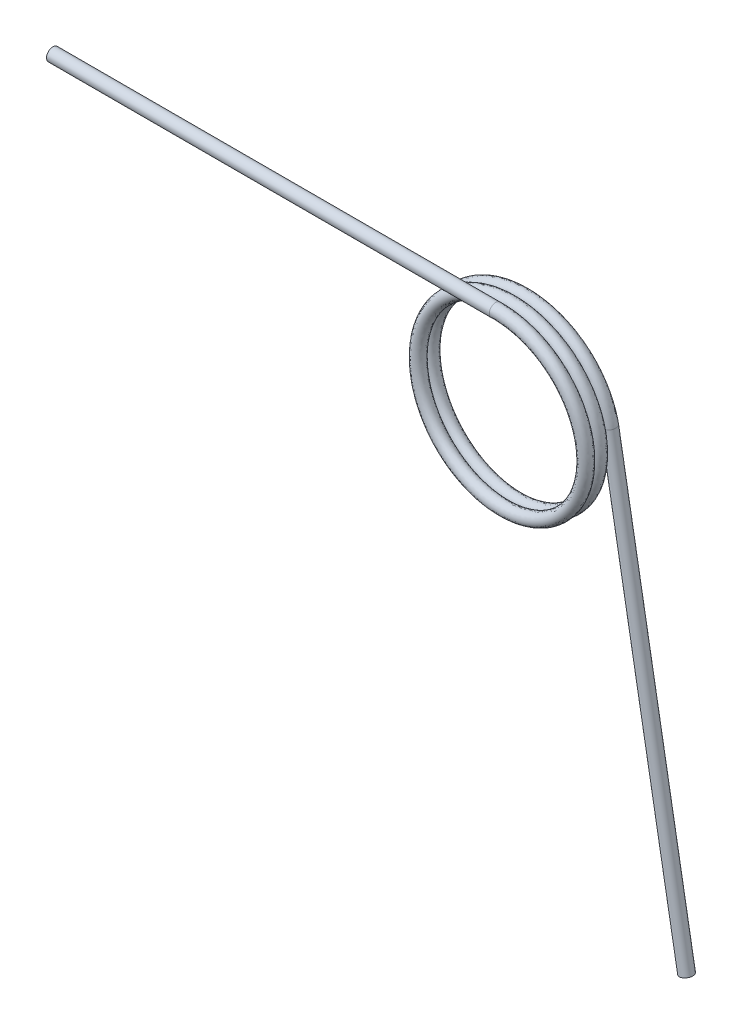
ISO-10303-21;
HEADER;
FILE_DESCRIPTION(('STEP AP214'),'2;1');
FILE_NAME('part.step','',(''),(''),'','','');
FILE_SCHEMA(('AUTOMOTIVE_DESIGN { 1 0 10303 214 1 1 1 1 }'));
ENDSEC;
DATA;
#1=APPLICATION_CONTEXT('core data for automotive mechanical design processes');
#2=APPLICATION_PROTOCOL_DEFINITION('international standard','automotive_design',2000,#1);
#3=PRODUCT_CONTEXT('',#1,'mechanical');
#4=PRODUCT('Part','Part','',(#3));
#5=PRODUCT_RELATED_PRODUCT_CATEGORY('part','',(#4));
#6=PRODUCT_DEFINITION_FORMATION('','',#4);
#7=PRODUCT_DEFINITION_CONTEXT('part definition',#1,'design');
#8=PRODUCT_DEFINITION('design','',#6,#7);
#9=PRODUCT_DEFINITION_SHAPE('','',#8);
#10=(LENGTH_UNIT() NAMED_UNIT(*) SI_UNIT(.MILLI.,.METRE.));
#11=(NAMED_UNIT(*) PLANE_ANGLE_UNIT() SI_UNIT($,.RADIAN.));
#12=(NAMED_UNIT(*) SI_UNIT($,.STERADIAN.) SOLID_ANGLE_UNIT());
#13=UNCERTAINTY_MEASURE_WITH_UNIT(LENGTH_MEASURE(1.E-05),#10,'distance_accuracy_value','');
#14=(GEOMETRIC_REPRESENTATION_CONTEXT(3) GLOBAL_UNCERTAINTY_ASSIGNED_CONTEXT((#13)) GLOBAL_UNIT_ASSIGNED_CONTEXT((#10,
#11,#12)) REPRESENTATION_CONTEXT('',''));
#15=CARTESIAN_POINT('',(0.,0.,0.));
#16=DIRECTION('',(0.,0.,1.));
#17=DIRECTION('',(1.,0.,0.));
#18=AXIS2_PLACEMENT_3D('',#15,#16,#17);
#19=CARTESIAN_POINT('',(0.,2.945,-0.215));
#20=CARTESIAN_POINT('',(-1.70029654276345,2.945,-0.178808333333333));
#21=CARTESIAN_POINT('',(-2.55044481414517,1.4725,-0.142616666666667));
#22=CARTESIAN_POINT('',(-3.4005930855269,0.,-0.106425));
#23=CARTESIAN_POINT('',(-2.55044481414517,-1.4725,-0.0702333333333334));
#24=CARTESIAN_POINT('',(-1.70029654276345,-2.945,-0.0340416666666667));
#25=CARTESIAN_POINT('',(0.,-2.945,0.00214999999999997));
#26=CARTESIAN_POINT('',(1.70029654276345,-2.945,0.0383416666666666));
#27=CARTESIAN_POINT('',(2.55044481414517,-1.4725,0.0745333333333333));
#28=CARTESIAN_POINT('',(3.4005930855269,0.,0.110725));
#29=CARTESIAN_POINT('',(2.55044481414517,1.4725,0.146916666666667));
#30=CARTESIAN_POINT('',(1.70029654276345,2.945,0.183108333333333));
#31=CARTESIAN_POINT('',(0.,2.945,0.2193));
#32=CARTESIAN_POINT('',(-1.70029654276345,2.945,0.255491666666667));
#33=CARTESIAN_POINT('',(-2.55044481414517,1.4725,0.291683333333333));
#34=CARTESIAN_POINT('',(-3.4005930855269,0.,0.327875));
#35=CARTESIAN_POINT('',(-2.55044481414517,-1.4725,0.364066666666667));
#36=CARTESIAN_POINT('',(-1.70029654276345,-2.945,0.400258333333333));
#37=CARTESIAN_POINT('',(0.,-2.945,0.43645));
#38=CARTESIAN_POINT('',(1.70029654276345,-2.945,0.472641666666667));
#39=CARTESIAN_POINT('',(2.55044481414517,-1.4725,0.508833333333333));
#40=CARTESIAN_POINT('',(3.4005930855269,0.,0.545025));
#41=CARTESIAN_POINT('',(2.55044481414517,1.4725,0.581216666666667));
#42=CARTESIAN_POINT('',(1.70029654276345,2.945,0.617408333333333));
#43=CARTESIAN_POINT('',(0.,2.945,0.6536));
#44=CARTESIAN_POINT('',(-1.70029654276345,2.945,0.689791666666667));
#45=CARTESIAN_POINT('',(-2.55044481414517,1.4725,0.725983333333333));
#46=CARTESIAN_POINT('',(-3.4005930855269,0.,0.762175));
#47=CARTESIAN_POINT('',(-2.55044481414517,-1.4725,0.798366666666667));
#48=CARTESIAN_POINT('',(-1.70029654276345,-2.945,0.834558333333333));
#49=CARTESIAN_POINT('',(0.,-2.945,0.87075));
#50=CARTESIAN_POINT('',(1.70029654276345,-2.945,0.906941666666667));
#51=CARTESIAN_POINT('',(2.55044481414517,-1.4725,0.943133333333333));
#52=CARTESIAN_POINT('',(3.4005930855269,0.,0.979325));
#53=CARTESIAN_POINT('',(2.55044481414517,1.4725,1.01551666666667));
#54=CARTESIAN_POINT('',(1.70029654276345,2.945,1.05170833333333));
#55=CARTESIAN_POINT('',(0.,2.945,1.0879));
#56=CARTESIAN_POINT('',(0.,3.375,-0.215));
#57=CARTESIAN_POINT('',(-1.94855715851499,3.375,-0.178808333333333));
#58=CARTESIAN_POINT('',(-2.92283573777248,1.6875,-0.142616666666667));
#59=CARTESIAN_POINT('',(-3.89711431702997,0.,-0.106425));
#60=CARTESIAN_POINT('',(-2.92283573777248,-1.6875,-0.0702333333333334));
#61=CARTESIAN_POINT('',(-1.94855715851499,-3.375,-0.0340416666666667));
#62=CARTESIAN_POINT('',(0.,-3.375,0.00214999999999997));
#63=CARTESIAN_POINT('',(1.94855715851499,-3.375,0.0383416666666666));
#64=CARTESIAN_POINT('',(2.92283573777248,-1.6875,0.0745333333333333));
#65=CARTESIAN_POINT('',(3.89711431702997,0.,0.110725));
#66=CARTESIAN_POINT('',(2.92283573777248,1.6875,0.146916666666667));
#67=CARTESIAN_POINT('',(1.94855715851499,3.375,0.183108333333333));
#68=CARTESIAN_POINT('',(0.,3.375,0.2193));
#69=CARTESIAN_POINT('',(-1.94855715851499,3.375,0.255491666666667));
#70=CARTESIAN_POINT('',(-2.92283573777248,1.6875,0.291683333333333));
#71=CARTESIAN_POINT('',(-3.89711431702997,0.,0.327875));
#72=CARTESIAN_POINT('',(-2.92283573777248,-1.6875,0.364066666666667));
#73=CARTESIAN_POINT('',(-1.94855715851499,-3.375,0.400258333333333));
#74=CARTESIAN_POINT('',(0.,-3.375,0.43645));
#75=CARTESIAN_POINT('',(1.94855715851499,-3.375,0.472641666666667));
#76=CARTESIAN_POINT('',(2.92283573777248,-1.6875,0.508833333333333));
#77=CARTESIAN_POINT('',(3.89711431702997,0.,0.545025));
#78=CARTESIAN_POINT('',(2.92283573777248,1.6875,0.581216666666667));
#79=CARTESIAN_POINT('',(1.94855715851499,3.375,0.617408333333333));
#80=CARTESIAN_POINT('',(0.,3.375,0.6536));
#81=CARTESIAN_POINT('',(-1.94855715851499,3.375,0.689791666666667));
#82=CARTESIAN_POINT('',(-2.92283573777248,1.6875,0.725983333333333));
#83=CARTESIAN_POINT('',(-3.89711431702997,0.,0.762175));
#84=CARTESIAN_POINT('',(-2.92283573777248,-1.6875,0.798366666666667));
#85=CARTESIAN_POINT('',(-1.94855715851499,-3.375,0.834558333333333));
#86=CARTESIAN_POINT('',(0.,-3.375,0.87075));
#87=CARTESIAN_POINT('',(1.94855715851499,-3.375,0.906941666666667));
#88=CARTESIAN_POINT('',(2.92283573777248,-1.6875,0.943133333333333));
#89=CARTESIAN_POINT('',(3.89711431702997,0.,0.979325));
#90=CARTESIAN_POINT('',(2.92283573777248,1.6875,1.01551666666667));
#91=CARTESIAN_POINT('',(1.94855715851499,3.375,1.05170833333333));
#92=CARTESIAN_POINT('',(0.,3.375,1.0879));
#93=CARTESIAN_POINT('',(0.,3.375,0.215));
#94=CARTESIAN_POINT('',(-1.94855715851499,3.375,0.251191666666667));
#95=CARTESIAN_POINT('',(-2.92283573777248,1.6875,0.287383333333333));
#96=CARTESIAN_POINT('',(-3.89711431702997,0.,0.323575));
#97=CARTESIAN_POINT('',(-2.92283573777248,-1.6875,0.359766666666667));
#98=CARTESIAN_POINT('',(-1.94855715851499,-3.375,0.395958333333333));
#99=CARTESIAN_POINT('',(0.,-3.375,0.43215));
#100=CARTESIAN_POINT('',(1.94855715851499,-3.375,0.468341666666667));
#101=CARTESIAN_POINT('',(2.92283573777248,-1.6875,0.504533333333333));
#102=CARTESIAN_POINT('',(3.89711431702997,0.,0.540725));
#103=CARTESIAN_POINT('',(2.92283573777248,1.6875,0.576916666666667));
#104=CARTESIAN_POINT('',(1.94855715851499,3.375,0.613108333333333));
#105=CARTESIAN_POINT('',(0.,3.375,0.6493));
#106=CARTESIAN_POINT('',(-1.94855715851499,3.375,0.685491666666667));
#107=CARTESIAN_POINT('',(-2.92283573777248,1.6875,0.721683333333333));
#108=CARTESIAN_POINT('',(-3.89711431702997,0.,0.757875));
#109=CARTESIAN_POINT('',(-2.92283573777248,-1.6875,0.794066666666667));
#110=CARTESIAN_POINT('',(-1.94855715851499,-3.375,0.830258333333333));
#111=CARTESIAN_POINT('',(0.,-3.375,0.86645));
#112=CARTESIAN_POINT('',(1.94855715851499,-3.375,0.902641666666667));
#113=CARTESIAN_POINT('',(2.92283573777248,-1.6875,0.938833333333334));
#114=CARTESIAN_POINT('',(3.89711431702997,0.,0.975025));
#115=CARTESIAN_POINT('',(2.92283573777248,1.6875,1.01121666666667));
#116=CARTESIAN_POINT('',(1.94855715851499,3.375,1.04740833333333));
#117=CARTESIAN_POINT('',(0.,3.375,1.0836));
#118=CARTESIAN_POINT('',(-1.94855715851499,3.375,1.11979166666667));
#119=CARTESIAN_POINT('',(-2.92283573777248,1.6875,1.15598333333333));
#120=CARTESIAN_POINT('',(-3.89711431702997,0.,1.192175));
#121=CARTESIAN_POINT('',(-2.92283573777248,-1.6875,1.22836666666667));
#122=CARTESIAN_POINT('',(-1.94855715851499,-3.375,1.26455833333333));
#123=CARTESIAN_POINT('',(0.,-3.375,1.30075));
#124=CARTESIAN_POINT('',(1.94855715851499,-3.375,1.33694166666667));
#125=CARTESIAN_POINT('',(2.92283573777248,-1.6875,1.37313333333333));
#126=CARTESIAN_POINT('',(3.89711431702997,0.,1.409325));
#127=CARTESIAN_POINT('',(2.92283573777248,1.6875,1.44551666666667));
#128=CARTESIAN_POINT('',(1.94855715851499,3.375,1.48170833333333));
#129=CARTESIAN_POINT('',(0.,3.375,1.5179));
#130=CARTESIAN_POINT('',(0.,2.945,0.215));
#131=CARTESIAN_POINT('',(-1.70029654276345,2.945,0.251191666666667));
#132=CARTESIAN_POINT('',(-2.55044481414517,1.4725,0.287383333333333));
#133=CARTESIAN_POINT('',(-3.4005930855269,0.,0.323575));
#134=CARTESIAN_POINT('',(-2.55044481414517,-1.4725,0.359766666666667));
#135=CARTESIAN_POINT('',(-1.70029654276345,-2.945,0.395958333333333));
#136=CARTESIAN_POINT('',(0.,-2.945,0.43215));
#137=CARTESIAN_POINT('',(1.70029654276345,-2.945,0.468341666666667));
#138=CARTESIAN_POINT('',(2.55044481414517,-1.4725,0.504533333333333));
#139=CARTESIAN_POINT('',(3.4005930855269,0.,0.540725));
#140=CARTESIAN_POINT('',(2.55044481414517,1.4725,0.576916666666667));
#141=CARTESIAN_POINT('',(1.70029654276345,2.945,0.613108333333333));
#142=CARTESIAN_POINT('',(0.,2.945,0.6493));
#143=CARTESIAN_POINT('',(-1.70029654276345,2.945,0.685491666666667));
#144=CARTESIAN_POINT('',(-2.55044481414517,1.4725,0.721683333333333));
#145=CARTESIAN_POINT('',(-3.4005930855269,0.,0.757875));
#146=CARTESIAN_POINT('',(-2.55044481414517,-1.4725,0.794066666666667));
#147=CARTESIAN_POINT('',(-1.70029654276345,-2.945,0.830258333333333));
#148=CARTESIAN_POINT('',(0.,-2.945,0.86645));
#149=CARTESIAN_POINT('',(1.70029654276345,-2.945,0.902641666666667));
#150=CARTESIAN_POINT('',(2.55044481414517,-1.4725,0.938833333333333));
#151=CARTESIAN_POINT('',(3.4005930855269,0.,0.975025));
#152=CARTESIAN_POINT('',(2.55044481414517,1.4725,1.01121666666667));
#153=CARTESIAN_POINT('',(1.70029654276345,2.945,1.04740833333333));
#154=CARTESIAN_POINT('',(0.,2.945,1.0836));
#155=CARTESIAN_POINT('',(-1.70029654276345,2.945,1.11979166666667));
#156=CARTESIAN_POINT('',(-2.55044481414517,1.4725,1.15598333333333));
#157=CARTESIAN_POINT('',(-3.4005930855269,0.,1.192175));
#158=CARTESIAN_POINT('',(-2.55044481414517,-1.4725,1.22836666666667));
#159=CARTESIAN_POINT('',(-1.70029654276345,-2.945,1.26455833333333));
#160=CARTESIAN_POINT('',(0.,-2.945,1.30075));
#161=CARTESIAN_POINT('',(1.70029654276345,-2.945,1.33694166666667));
#162=CARTESIAN_POINT('',(2.55044481414517,-1.4725,1.37313333333333));
#163=CARTESIAN_POINT('',(3.4005930855269,0.,1.409325));
#164=CARTESIAN_POINT('',(2.55044481414517,1.4725,1.44551666666667));
#165=CARTESIAN_POINT('',(1.70029654276345,2.945,1.48170833333333));
#166=CARTESIAN_POINT('',(0.,2.945,1.5179));
#167=CARTESIAN_POINT('',(0.,2.515,0.215));
#168=CARTESIAN_POINT('',(-1.45203592701191,2.515,0.251191666666667));
#169=CARTESIAN_POINT('',(-2.17805389051786,1.2575,0.287383333333333));
#170=CARTESIAN_POINT('',(-2.90407185402382,0.,0.323575));
#171=CARTESIAN_POINT('',(-2.17805389051786,-1.2575,0.359766666666667));
#172=CARTESIAN_POINT('',(-1.45203592701191,-2.515,0.395958333333334));
#173=CARTESIAN_POINT('',(0.,-2.515,0.43215));
#174=CARTESIAN_POINT('',(1.45203592701191,-2.515,0.468341666666667));
#175=CARTESIAN_POINT('',(2.17805389051786,-1.2575,0.504533333333333));
#176=CARTESIAN_POINT('',(2.90407185402382,0.,0.540725));
#177=CARTESIAN_POINT('',(2.17805389051786,1.2575,0.576916666666667));
#178=CARTESIAN_POINT('',(1.45203592701191,2.515,0.613108333333333));
#179=CARTESIAN_POINT('',(0.,2.515,0.6493));
#180=CARTESIAN_POINT('',(-1.45203592701191,2.515,0.685491666666667));
#181=CARTESIAN_POINT('',(-2.17805389051786,1.2575,0.721683333333333));
#182=CARTESIAN_POINT('',(-2.90407185402382,0.,0.757875));
#183=CARTESIAN_POINT('',(-2.17805389051786,-1.2575,0.794066666666667));
#184=CARTESIAN_POINT('',(-1.45203592701191,-2.515,0.830258333333333));
#185=CARTESIAN_POINT('',(0.,-2.515,0.86645));
#186=CARTESIAN_POINT('',(1.45203592701191,-2.515,0.902641666666667));
#187=CARTESIAN_POINT('',(2.17805389051786,-1.2575,0.938833333333334));
#188=CARTESIAN_POINT('',(2.90407185402382,0.,0.975025));
#189=CARTESIAN_POINT('',(2.17805389051786,1.2575,1.01121666666667));
#190=CARTESIAN_POINT('',(1.45203592701191,2.515,1.04740833333333));
#191=CARTESIAN_POINT('',(0.,2.515,1.0836));
#192=CARTESIAN_POINT('',(-1.45203592701191,2.515,1.11979166666667));
#193=CARTESIAN_POINT('',(-2.17805389051786,1.2575,1.15598333333333));
#194=CARTESIAN_POINT('',(-2.90407185402382,0.,1.192175));
#195=CARTESIAN_POINT('',(-2.17805389051786,-1.2575,1.22836666666667));
#196=CARTESIAN_POINT('',(-1.45203592701191,-2.515,1.26455833333333));
#197=CARTESIAN_POINT('',(0.,-2.515,1.30075));
#198=CARTESIAN_POINT('',(1.45203592701191,-2.515,1.33694166666667));
#199=CARTESIAN_POINT('',(2.17805389051786,-1.2575,1.37313333333333));
#200=CARTESIAN_POINT('',(2.90407185402382,0.,1.409325));
#201=CARTESIAN_POINT('',(2.17805389051786,1.2575,1.44551666666667));
#202=CARTESIAN_POINT('',(1.45203592701191,2.515,1.48170833333333));
#203=CARTESIAN_POINT('',(0.,2.515,1.5179));
#204=CARTESIAN_POINT('',(0.,2.515,-0.215));
#205=CARTESIAN_POINT('',(-1.45203592701191,2.515,-0.178808333333333));
#206=CARTESIAN_POINT('',(-2.17805389051786,1.2575,-0.142616666666667));
#207=CARTESIAN_POINT('',(-2.90407185402382,0.,-0.106425));
#208=CARTESIAN_POINT('',(-2.17805389051786,-1.2575,-0.0702333333333334));
#209=CARTESIAN_POINT('',(-1.45203592701191,-2.515,-0.0340416666666667));
#210=CARTESIAN_POINT('',(0.,-2.515,0.00214999999999997));
#211=CARTESIAN_POINT('',(1.45203592701191,-2.515,0.0383416666666666));
#212=CARTESIAN_POINT('',(2.17805389051786,-1.2575,0.0745333333333333));
#213=CARTESIAN_POINT('',(2.90407185402382,0.,0.110725));
#214=CARTESIAN_POINT('',(2.17805389051786,1.2575,0.146916666666667));
#215=CARTESIAN_POINT('',(1.45203592701191,2.515,0.183108333333333));
#216=CARTESIAN_POINT('',(0.,2.515,0.2193));
#217=CARTESIAN_POINT('',(-1.45203592701191,2.515,0.255491666666667));
#218=CARTESIAN_POINT('',(-2.17805389051786,1.2575,0.291683333333333));
#219=CARTESIAN_POINT('',(-2.90407185402382,0.,0.327875));
#220=CARTESIAN_POINT('',(-2.17805389051786,-1.2575,0.364066666666667));
#221=CARTESIAN_POINT('',(-1.45203592701191,-2.515,0.400258333333333));
#222=CARTESIAN_POINT('',(0.,-2.515,0.43645));
#223=CARTESIAN_POINT('',(1.45203592701191,-2.515,0.472641666666667));
#224=CARTESIAN_POINT('',(2.17805389051786,-1.2575,0.508833333333333));
#225=CARTESIAN_POINT('',(2.90407185402382,0.,0.545025));
#226=CARTESIAN_POINT('',(2.17805389051786,1.2575,0.581216666666667));
#227=CARTESIAN_POINT('',(1.45203592701191,2.515,0.617408333333333));
#228=CARTESIAN_POINT('',(0.,2.515,0.6536));
#229=CARTESIAN_POINT('',(-1.45203592701191,2.515,0.689791666666667));
#230=CARTESIAN_POINT('',(-2.17805389051786,1.2575,0.725983333333333));
#231=CARTESIAN_POINT('',(-2.90407185402382,0.,0.762175));
#232=CARTESIAN_POINT('',(-2.17805389051786,-1.2575,0.798366666666667));
#233=CARTESIAN_POINT('',(-1.45203592701191,-2.515,0.834558333333333));
#234=CARTESIAN_POINT('',(0.,-2.515,0.87075));
#235=CARTESIAN_POINT('',(1.45203592701191,-2.515,0.906941666666667));
#236=CARTESIAN_POINT('',(2.17805389051786,-1.2575,0.943133333333333));
#237=CARTESIAN_POINT('',(2.90407185402382,0.,0.979325));
#238=CARTESIAN_POINT('',(2.17805389051786,1.2575,1.01551666666667));
#239=CARTESIAN_POINT('',(1.45203592701191,2.515,1.05170833333333));
#240=CARTESIAN_POINT('',(0.,2.515,1.0879));
#241=CARTESIAN_POINT('',(0.,2.945,-0.215));
#242=CARTESIAN_POINT('',(-1.70029654276345,2.945,-0.178808333333333));
#243=CARTESIAN_POINT('',(-2.55044481414517,1.4725,-0.142616666666667));
#244=CARTESIAN_POINT('',(-3.4005930855269,0.,-0.106425));
#245=CARTESIAN_POINT('',(-2.55044481414517,-1.4725,-0.0702333333333334));
#246=CARTESIAN_POINT('',(-1.70029654276345,-2.945,-0.0340416666666667));
#247=CARTESIAN_POINT('',(0.,-2.945,0.00214999999999997));
#248=CARTESIAN_POINT('',(1.70029654276345,-2.945,0.0383416666666666));
#249=CARTESIAN_POINT('',(2.55044481414517,-1.4725,0.0745333333333333));
#250=CARTESIAN_POINT('',(3.4005930855269,0.,0.110725));
#251=CARTESIAN_POINT('',(2.55044481414517,1.4725,0.146916666666667));
#252=CARTESIAN_POINT('',(1.70029654276345,2.945,0.183108333333333));
#253=CARTESIAN_POINT('',(0.,2.945,0.2193));
#254=CARTESIAN_POINT('',(-1.70029654276345,2.945,0.255491666666667));
#255=CARTESIAN_POINT('',(-2.55044481414517,1.4725,0.291683333333333));
#256=CARTESIAN_POINT('',(-3.4005930855269,0.,0.327875));
#257=CARTESIAN_POINT('',(-2.55044481414517,-1.4725,0.364066666666667));
#258=CARTESIAN_POINT('',(-1.70029654276345,-2.945,0.400258333333333));
#259=CARTESIAN_POINT('',(0.,-2.945,0.43645));
#260=CARTESIAN_POINT('',(1.70029654276345,-2.945,0.472641666666667));
#261=CARTESIAN_POINT('',(2.55044481414517,-1.4725,0.508833333333333));
#262=CARTESIAN_POINT('',(3.4005930855269,0.,0.545025));
#263=CARTESIAN_POINT('',(2.55044481414517,1.4725,0.581216666666667));
#264=CARTESIAN_POINT('',(1.70029654276345,2.945,0.617408333333333));
#265=CARTESIAN_POINT('',(0.,2.945,0.6536));
#266=CARTESIAN_POINT('',(-1.70029654276345,2.945,0.689791666666667));
#267=CARTESIAN_POINT('',(-2.55044481414517,1.4725,0.725983333333333));
#268=CARTESIAN_POINT('',(-3.4005930855269,0.,0.762175));
#269=CARTESIAN_POINT('',(-2.55044481414517,-1.4725,0.798366666666667));
#270=CARTESIAN_POINT('',(-1.70029654276345,-2.945,0.834558333333333));
#271=CARTESIAN_POINT('',(0.,-2.945,0.87075));
#272=CARTESIAN_POINT('',(1.70029654276345,-2.945,0.906941666666667));
#273=CARTESIAN_POINT('',(2.55044481414517,-1.4725,0.943133333333333));
#274=CARTESIAN_POINT('',(3.4005930855269,0.,0.979325));
#275=CARTESIAN_POINT('',(2.55044481414517,1.4725,1.01551666666667));
#276=CARTESIAN_POINT('',(1.70029654276345,2.945,1.05170833333333));
#277=CARTESIAN_POINT('',(0.,2.945,1.0879));
#278=(BOUNDED_SURFACE() B_SPLINE_SURFACE(3,2,((#19,#20,#21,#22,#23,#24,#25,#26,#27,#28,#29,#30,
#31,#32,#33,#34,#35,#36,#37,#38,#39,#40,#41,#42,#43,#44,#45,#46,#47,#48,#49,#50,#51,#52,#53,#54,
#55),(#56,#57,#58,#59,#60,#61,#62,#63,#64,#65,#66,#67,#68,#69,#70,#71,#72,#73,#74,#75,#76,#77,
#78,#79,#80,#81,#82,#83,#84,#85,#86,#87,#88,#89,#90,#91,#92),(#93,#94,#95,#96,#97,#98,#99,#100,
#101,#102,#103,#104,#105,#106,#107,#108,#109,#110,#111,#112,#113,#114,#115,#116,#117,#118,#119,
#120,#121,#122,#123,#124,#125,#126,#127,#128,#129),(#130,#131,#132,#133,#134,#135,#136,#137,
#138,#139,#140,#141,#142,#143,#144,#145,#146,#147,#148,#149,#150,#151,#152,#153,#154,#155,#156,
#157,#158,#159,#160,#161,#162,#163,#164,#165,#166),(#167,#168,#169,#170,#171,#172,#173,#174,
#175,#176,#177,#178,#179,#180,#181,#182,#183,#184,#185,#186,#187,#188,#189,#190,#191,#192,#193,
#194,#195,#196,#197,#198,#199,#200,#201,#202,#203),(#204,#205,#206,#207,#208,#209,#210,#211,
#212,#213,#214,#215,#216,#217,#218,#219,#220,#221,#222,#223,#224,#225,#226,#227,#228,#229,#230,
#231,#232,#233,#234,#235,#236,#237,#238,#239,#240),(#241,#242,#243,#244,#245,#246,#247,#248,
#249,#250,#251,#252,#253,#254,#255,#256,#257,#258,#259,#260,#261,#262,#263,#264,#265,#266,#267,
#268,#269,#270,#271,#272,#273,#274,#275,#276,#277)),.UNSPECIFIED.,.T.,.F.,
.F.) B_SPLINE_SURFACE_WITH_KNOTS((4,3,4),(3,2,2,2,2,2,2,2,2,2,2,2,2,2,2,2,2,2,3),(0.,0.5,1.),
(0.,0.0555555555555556,0.111111111111111,0.166666666666667,0.222222222222222,0.277777777777778,
0.333333333333333,0.388888888888889,0.444444444444444,0.5,0.555555555555556,0.611111111111111,
0.666666666666667,0.722222222222222,0.777777777777778,0.833333333333333,0.888888888888889,
0.944444444444444,1.),
.UNSPECIFIED.) GEOMETRIC_REPRESENTATION_ITEM() RATIONAL_B_SPLINE_SURFACE(((1.,0.866025403784439,
1.,0.866025403784439,1.,0.866025403784439,1.,0.866025403784439,1.,0.866025403784439,1.,
0.866025403784439,1.,0.866025403784439,1.,0.866025403784439,1.,0.866025403784439,1.,
0.866025403784439,1.,0.866025403784439,1.,0.866025403784439,1.,0.866025403784439,1.,
0.866025403784439,1.,0.866025403784439,1.,0.866025403784439,1.,0.866025403784439,1.,
0.866025403784439,1.),(0.333333333333333,0.288675134594813,0.333333333333333,0.288675134594813,
0.333333333333333,0.288675134594813,0.333333333333333,0.288675134594813,0.333333333333333,
0.288675134594813,0.333333333333333,0.288675134594813,0.333333333333333,0.288675134594813,
0.333333333333333,0.288675134594813,0.333333333333333,0.288675134594813,0.333333333333333,
0.288675134594813,0.333333333333333,0.288675134594813,0.333333333333333,0.288675134594813,
0.333333333333333,0.288675134594813,0.333333333333333,0.288675134594813,0.333333333333333,
0.288675134594813,0.333333333333333,0.288675134594813,0.333333333333333,0.288675134594813,
0.333333333333333,0.288675134594813,0.333333333333333),(0.333333333333333,0.288675134594813,
0.333333333333333,0.288675134594813,0.333333333333333,0.288675134594813,0.333333333333333,
0.288675134594813,0.333333333333333,0.288675134594813,0.333333333333333,0.288675134594813,
0.333333333333333,0.288675134594813,0.333333333333333,0.288675134594813,0.333333333333333,
0.288675134594813,0.333333333333333,0.288675134594813,0.333333333333333,0.288675134594813,
0.333333333333333,0.288675134594813,0.333333333333333,0.288675134594813,0.333333333333333,
0.288675134594813,0.333333333333333,0.288675134594813,0.333333333333333,0.288675134594813,
0.333333333333333,0.288675134594813,0.333333333333333,0.288675134594813,0.333333333333333),(1.,
0.866025403784439,1.,0.866025403784439,1.,0.866025403784439,1.,0.866025403784439,1.,
0.866025403784439,1.,0.866025403784439,1.,0.866025403784439,1.,0.866025403784439,1.,
0.866025403784439,1.,0.866025403784439,1.,0.866025403784439,1.,0.866025403784439,1.,
0.866025403784439,1.,0.866025403784439,1.,0.866025403784439,1.,0.866025403784439,1.,
0.866025403784439,1.,0.866025403784439,1.),(0.333333333333333,0.288675134594813,
0.333333333333333,0.288675134594813,0.333333333333333,0.288675134594813,0.333333333333333,
0.288675134594813,0.333333333333333,0.288675134594813,0.333333333333333,0.288675134594813,
0.333333333333333,0.288675134594813,0.333333333333333,0.288675134594813,0.333333333333333,
0.288675134594813,0.333333333333333,0.288675134594813,0.333333333333333,0.288675134594813,
0.333333333333333,0.288675134594813,0.333333333333333,0.288675134594813,0.333333333333333,
0.288675134594813,0.333333333333333,0.288675134594813,0.333333333333333,0.288675134594813,
0.333333333333333,0.288675134594813,0.333333333333333,0.288675134594813,0.333333333333333),
(0.333333333333333,0.288675134594813,0.333333333333333,0.288675134594813,0.333333333333333,
0.288675134594813,0.333333333333333,0.288675134594813,0.333333333333333,0.288675134594813,
0.333333333333333,0.288675134594813,0.333333333333333,0.288675134594813,0.333333333333333,
0.288675134594813,0.333333333333333,0.288675134594813,0.333333333333333,0.288675134594813,
0.333333333333333,0.288675134594813,0.333333333333333,0.288675134594813,0.333333333333333,
0.288675134594813,0.333333333333333,0.288675134594813,0.333333333333333,0.288675134594813,
0.333333333333333,0.288675134594813,0.333333333333333,0.288675134594813,0.333333333333333,
0.288675134594813,0.333333333333333),(1.,0.866025403784439,1.,0.866025403784439,1.,
0.866025403784439,1.,0.866025403784439,1.,0.866025403784439,1.,0.866025403784439,1.,
0.866025403784439,1.,0.866025403784439,1.,0.866025403784439,1.,0.866025403784439,1.,
0.866025403784439,1.,0.866025403784439,1.,0.866025403784439,1.,0.866025403784439,1.,
0.866025403784439,1.,0.866025403784439,1.,0.866025403784439,1.,0.866025403784439,1.))) REPRESENTATION_ITEM('') SURFACE());
#279=CARTESIAN_POINT('',(2.94239100570403,-0.123936151110097,0.541978850004137));
#280=CARTESIAN_POINT('',(2.93871071864706,-0.0882297979870135,0.542848703910686));
#281=CARTESIAN_POINT('',(2.93573370136734,-0.0524561192601714,0.543898442779504));
#282=CARTESIAN_POINT('',(2.93178684356249,0.00126089021852464,0.545462392790058));
#283=CARTESIAN_POINT('',(2.93055702455397,0.0191879065672348,0.545982274988312));
#284=CARTESIAN_POINT('',(2.92824878773339,0.0550490372665367,0.547000945224128));
#285=CARTESIAN_POINT('',(2.9271703390526,0.0729831494198308,0.547499737547977));
#286=CARTESIAN_POINT('',(2.92515447332862,0.108821935556432,0.548460054935103));
#287=CARTESIAN_POINT('',(2.92421676091779,0.126726590924886,0.5489216570794));
#288=CARTESIAN_POINT('',(2.92251028753349,0.162556368196737,0.549802114174605));
#289=CARTESIAN_POINT('',(2.92174163490512,0.180481495867369,0.550220941620999));
#290=CARTESIAN_POINT('',(2.92046011978981,0.216306135021606,0.551011992340297));
#291=CARTESIAN_POINT('',(2.91994672633664,0.234205621798469,0.551384311137142));
#292=CARTESIAN_POINT('',(2.91962593051045,0.261054027281792,0.551910007711176));
#293=CARTESIAN_POINT('',(2.91959379206514,0.269999218941921,0.552079705338982));
#294=CARTESIAN_POINT('',(2.91980716547732,0.287885168319576,0.552409163697722));
#295=CARTESIAN_POINT('',(2.92005258536428,0.296825926524305,0.552568927701719));
#296=CARTESIAN_POINT('',(2.92098647294862,0.310811735772954,0.552813727578783));
#297=CARTESIAN_POINT('',(2.92143696830905,0.315866635034941,0.552901155174885));
#298=CARTESIAN_POINT('',(2.92250486648998,0.322665238990843,0.553020075997244));
#299=CARTESIAN_POINT('',(2.92282891015001,0.324449035293586,0.553051404761411));
#300=CARTESIAN_POINT('',(2.92350287989077,0.327327653293321,0.553102954564255));
#301=CARTESIAN_POINT('',(2.92379959651021,0.328434916810594,0.553123029545006));
#302=CARTESIAN_POINT('',(2.92450042466657,0.330580389001461,0.553162939978818));
#303=CARTESIAN_POINT('',(2.9249006283193,0.3316196692713,0.553182761124694));
#304=CARTESIAN_POINT('',(2.92572889495134,0.333141454573458,0.553214133502473));
#305=CARTESIAN_POINT('',(2.92606768991925,0.333668177070376,0.553225497439557));
#306=CARTESIAN_POINT('',(2.92675113025998,0.334449742569465,0.553244236724578));
#307=CARTESIAN_POINT('',(2.92705571525055,0.334736526152003,0.553251671697744));
#308=CARTESIAN_POINT('',(2.92794219793731,0.335265857513979,0.553268914704837));
#309=CARTESIAN_POINT('',(2.92858711526835,0.335423182268953,0.553278179743168));
#310=CARTESIAN_POINT('',(2.92956588064314,0.335313548231536,0.553287483858984));
#311=CARTESIAN_POINT('',(2.92992281292418,0.33518835158292,0.553289713307278));
#312=CARTESIAN_POINT('',(2.93083423558497,0.334745503101734,0.55329379919123));
#313=CARTESIAN_POINT('',(2.93134698968291,0.334354227642613,0.553294243286288));
#314=CARTESIAN_POINT('',(2.93256019132052,0.333246051202894,0.553293042209838));
#315=CARTESIAN_POINT('',(2.93320074509631,0.332470755746979,0.553290060005953));
#316=CARTESIAN_POINT('',(2.93439042969501,0.330848794755495,0.553282450960126));
#317=CARTESIAN_POINT('',(2.93493878099141,0.330001603738645,0.553277811039743));
#318=CARTESIAN_POINT('',(2.93665010355292,0.327155770398576,0.5532612009349));
#319=CARTESIAN_POINT('',(2.93769090798369,0.325084819155039,0.553247510603808));
#320=CARTESIAN_POINT('',(2.93963996318481,0.320880707433147,0.553219054673843));
#321=CARTESIAN_POINT('',(2.94054786592182,0.318747400570043,0.553204286398341));
#322=CARTESIAN_POINT('',(2.94314293279971,0.312303890208538,0.553159606607217));
#323=CARTESIAN_POINT('',(2.94470492048526,0.30794311500125,0.553129272038442));
#324=CARTESIAN_POINT('',(2.94912107339706,0.294855114236517,0.553040811212938));
#325=CARTESIAN_POINT('',(2.95173554260602,0.28605079716852,0.55298468798263));
#326=CARTESIAN_POINT('',(2.95665061410111,0.268346973900376,0.552881834896887));
#327=CARTESIAN_POINT('',(2.95895085466589,0.259447370505712,0.552835115838178));
#328=CARTESIAN_POINT('',(2.96332870013901,0.241598904732666,0.552752342571005));
#329=CARTESIAN_POINT('',(2.96540642582376,0.232650071876841,0.552716282558132));
#330=CARTESIAN_POINT('',(2.96938837618949,0.214718943572004,0.552655303007534));
#331=CARTESIAN_POINT('',(2.97129268676199,0.205736667007529,0.55263037793058));
#332=CARTESIAN_POINT('',(2.97827232184738,0.171463425357402,0.552557083649798));
#333=CARTESIAN_POINT('',(2.98285081294724,0.146070368822,0.552547895579014));
#334=CARTESIAN_POINT('',(2.9910718668712,0.0951215441640685,0.552609008067307));
#335=CARTESIAN_POINT('',(2.99471390855188,0.0695656935164318,0.55267935277015));
#336=CARTESIAN_POINT('',(3.00103960439636,0.0183708247918543,0.552865030200177));
#337=CARTESIAN_POINT('',(3.00372456923436,-0.00726803064940323,0.552980300946451));
#338=CARTESIAN_POINT('',(3.00803243291172,-0.0586210231522066,0.55318813302766));
#339=CARTESIAN_POINT('',(3.00965608326671,-0.0843350939656322,0.55328071040265));
#340=CARTESIAN_POINT('',(3.01109148807786,-0.122908037879063,0.553298497310076));
#341=CARTESIAN_POINT('',(3.01140352601642,-0.135748800258615,0.553284345981825));
#342=CARTESIAN_POINT('',(3.01163276879359,-0.16144869565655,0.553185615372022));
#343=CARTESIAN_POINT('',(3.0115495675256,-0.174307833992302,0.553100963725354));
#344=CARTESIAN_POINT('',(3.01087171314308,-0.200102985802824,0.552811989184836));
#345=CARTESIAN_POINT('',(3.0102733752099,-0.21303888474121,0.552606807495986));
#346=CARTESIAN_POINT('',(3.00836342508227,-0.238840420878434,0.551996807822672));
#347=CARTESIAN_POINT('',(3.00705347040802,-0.25170615145122,0.551592453959675));
#348=CARTESIAN_POINT('',(3.0045211594306,-0.267662874852017,0.550810457123807));
#349=CARTESIAN_POINT('',(3.00396618130553,-0.270867060778053,0.550639064868071));
#350=CARTESIAN_POINT('',(3.00272763128626,-0.277256111425065,0.550256454906316));
#351=CARTESIAN_POINT('',(3.0020437821826,-0.280440918926816,0.550045151346323));
#352=CARTESIAN_POINT('',(3.00050304165806,-0.286724813717331,0.549569414820817));
#353=CARTESIAN_POINT('',(2.99964832222626,-0.289824470888886,0.549305648916436));
#354=CARTESIAN_POINT('',(2.99765953493957,-0.295920338157306,0.548693876498258));
#355=CARTESIAN_POINT('',(2.99652638974617,-0.298916853397166,0.548346148287578));
#356=CARTESIAN_POINT('',(2.99420702455331,-0.303528144262868,0.547642710599348));
#357=CARTESIAN_POINT('',(2.99320756955393,-0.305232354582471,0.547341130608368));
#358=CARTESIAN_POINT('',(2.99131890600704,-0.307528442218584,0.546780925372854));
#359=CARTESIAN_POINT('',(2.99060431405699,-0.308263267347211,0.54657037061347));
#360=CARTESIAN_POINT('',(2.98916208657383,-0.309330716139022,0.5461514961575));
#361=CARTESIAN_POINT('',(2.9884753736935,-0.309716996451932,0.545953834166411));
#362=CARTESIAN_POINT('',(2.98714133289019,-0.310146519195519,0.545575860100065));
#363=CARTESIAN_POINT('',(2.98651088427572,-0.310240611352889,0.545399275660682));
#364=CARTESIAN_POINT('',(2.98525802136339,-0.310196273301821,0.545053606093996));
#365=CARTESIAN_POINT('',(2.98463560537582,-0.310057892826017,0.544884519370656));
#366=CARTESIAN_POINT('',(2.98318722958511,-0.309509721710678,0.544497101059686));
#367=CARTESIAN_POINT('',(2.98239770378169,-0.309005011285467,0.544291423239523));
#368=CARTESIAN_POINT('',(2.98031336952834,-0.307324760022416,0.543759628114694));
#369=CARTESIAN_POINT('',(2.97918706285305,-0.305950165693762,0.543487276703096));
#370=CARTESIAN_POINT('',(2.97642617119103,-0.301996745324823,0.542842940602144));
#371=CARTESIAN_POINT('',(2.97501989813196,-0.299270748617883,0.54254313574549));
#372=CARTESIAN_POINT('',(2.97249255015029,-0.293670601320777,0.542037791975069));
#373=CARTESIAN_POINT('',(2.97137346522801,-0.290795574587799,0.541832903287633));
#374=CARTESIAN_POINT('',(2.96787964904716,-0.280978597248807,0.541237872159142));
#375=CARTESIAN_POINT('',(2.96589971118492,-0.27389189771922,0.540981522676553));
#376=CARTESIAN_POINT('',(2.9623422111728,-0.259612768948262,0.5406151915743));
#377=CARTESIAN_POINT('',(2.96076558637481,-0.252420133765999,0.540505548463787));
#378=CARTESIAN_POINT('',(2.95787581409626,-0.237990153663313,0.540382528317964));
#379=CARTESIAN_POINT('',(2.95656230430822,-0.230752884566685,0.540369018010502));
#380=CARTESIAN_POINT('',(2.95411242004829,-0.216257970558467,0.540406796240319));
#381=CARTESIAN_POINT('',(2.95297585751533,-0.209000355741147,0.540458015447108));
#382=CARTESIAN_POINT('',(2.94999737642941,-0.188805556033181,0.540664949154643));
#383=CARTESIAN_POINT('',(2.94829569767742,-0.175848201100654,0.54087098356072));
#384=CARTESIAN_POINT('',(2.94516205125305,-0.149908911090888,0.541369713199226));
#385=CARTESIAN_POINT('',(2.94372998325089,-0.136926986980234,0.541662376090041));
#386=CARTESIAN_POINT('',(2.94239100570403,-0.123936151110097,0.541978850004137));
#387=B_SPLINE_CURVE_WITH_KNOTS('',3,(#279,#280,#281,#282,#283,#284,#285,#286,#287,#288,#289,
#290,#291,#292,#293,#294,#295,#296,#297,#298,#299,#300,#301,#302,#303,#304,#305,#306,#307,#308,
#309,#310,#311,#312,#313,#314,#315,#316,#317,#318,#319,#320,#321,#322,#323,#324,#325,#326,#327,
#328,#329,#330,#331,#332,#333,#334,#335,#336,#337,#338,#339,#340,#341,#342,#343,#344,#345,#346,
#347,#348,#349,#350,#351,#352,#353,#354,#355,#356,#357,#358,#359,#360,#361,#362,#363,#364,#365,
#366,#367,#368,#369,#370,#371,#372,#373,#374,#375,#376,#377,#378,#379,#380,#381,#382,#383,#384,
#385,#386),.UNSPECIFIED.,.T.,.F.,(4,2,2,2,2,2,2,2,2,2,2,2,2,2,2,2,2,2,2,2,2,2,2,2,2,2,2,2,2,2,2,
2,2,2,2,2,2,2,2,2,2,2,2,2,2,2,2,2,2,2,2,2,2,4),(0.,0.107717484752793,0.161647948317094,
0.215567397891889,0.269372053160357,0.323211090317794,0.376937663065136,0.403776120772799,
0.430605688007964,0.445813178573463,0.451246720357811,0.454684803321327,0.458008327627262,
0.459873612650009,0.461113392788966,0.46294012970757,0.464053102114583,0.465963687736824,
0.46896467905711,0.471989889181777,0.478927109732357,0.485882183891589,0.499769014865061,
0.527311088794434,0.554884605062182,0.582443078328917,0.609987826942439,0.68737122664387,
0.764797598220265,0.842117526732821,0.919382645607194,0.957912178934333,0.996481309749529,
1.03532864312297,1.07408587762355,1.0838531793745,1.09364173610683,1.10331298480582,
1.11295260673256,1.11889797872126,1.12200882474125,1.12440307817841,1.12634707521764,
1.12829065643251,1.13111958799189,1.13644354154434,1.14564997757776,1.1549185824652,
1.17695963709117,1.19905146187618,1.22111265404034,1.24315023691616,1.28235508436804,
1.32154531362344),.UNSPECIFIED.);
#388=CARTESIAN_POINT('',(2.94239100570403,-0.123936151110097,0.541978850004137));
#389=VERTEX_POINT('',#388);
#390=EDGE_CURVE('E44',#389,#389,#387,.T.);
#391=CARTESIAN_POINT('',(2.90026095537191,0.511381844364098,0.123293938030975));
#392=CARTESIAN_POINT('',(2.4767933116334,0.436714885764246,0.123293938030975));
#393=CARTESIAN_POINT('',(2.4767933116334,0.436714885764246,0.553293938030975));
#394=CARTESIAN_POINT('',(2.90026095537191,0.511381844364098,0.553293938030975));
#395=CARTESIAN_POINT('',(3.32372859911042,0.586048802963949,0.553293938030975));
#396=CARTESIAN_POINT('',(3.32372859911042,0.586048802963949,0.123293938030975));
#397=CARTESIAN_POINT('',(2.90026095537191,0.511381844364098,0.123293938030975));
#398=(BOUNDED_CURVE() B_SPLINE_CURVE(3,(#391,#392,#393,#394,#395,#396,#397),.UNSPECIFIED.,.T.,
.F.) B_SPLINE_CURVE_WITH_KNOTS((4,3,4),(0.,0.5,1.),
.UNSPECIFIED.) CURVE() GEOMETRIC_REPRESENTATION_ITEM() RATIONAL_B_SPLINE_CURVE((0.940153888098828,
0.313384629366276,0.313384629366276,0.940153888098828,0.313384629366276,0.313384629366276,0.940153888098828)) REPRESENTATION_ITEM(''));
#399=CARTESIAN_POINT('',(2.90026095537191,0.511381844364098,0.123293938030975));
#400=VERTEX_POINT('',#399);
#401=EDGE_CURVE('E82',#400,#400,#398,.F.);
#402=CARTESIAN_POINT('',(0.,2.945,1.3029));
#403=DIRECTION('',(-1.,0.,0.));
#404=DIRECTION('',(0.,0.,1.));
#405=AXIS2_PLACEMENT_3D('',#402,#403,#404);
#406=CIRCLE('',#405,0.215);
#407=CARTESIAN_POINT('',(0.,2.945,1.5179));
#408=VERTEX_POINT('',#407);
#409=EDGE_CURVE('E49',#408,#408,#406,.T.);
#410=CARTESIAN_POINT('',(-0.606859765618095,2.94500000000001,1.08789999999993));
#411=CARTESIAN_POINT('',(-0.624658714247543,2.94271786700745,1.08790129802542));
#412=CARTESIAN_POINT('',(-0.642416630729697,2.94011905260881,1.08793592998724));
#413=CARTESIAN_POINT('',(-0.677779255778381,2.93411355551708,1.08815325154046));
#414=CARTESIAN_POINT('',(-0.695384143606867,2.93070800559894,1.08833573438933));
#415=CARTESIAN_POINT('',(-0.721561381252477,2.92463737871758,1.08885749014836));
#416=CARTESIAN_POINT('',(-0.730248112983217,2.92245365952927,1.08907272099432));
#417=CARTESIAN_POINT('',(-0.747524095707224,2.91761888403889,1.08963565904181));
#418=CARTESIAN_POINT('',(-0.756112988830128,2.91496648430885,1.08998375049526));
#419=CARTESIAN_POINT('',(-0.76875811118187,2.91028615663946,1.09071551033209));
#420=CARTESIAN_POINT('',(-0.772944468587504,2.90860357123169,1.09099541316134));
#421=CARTESIAN_POINT('',(-0.781119480374716,2.90485415515678,1.09167189226507));
#422=CARTESIAN_POINT('',(-0.785108874670268,2.90278892745892,1.0920679856886));
#423=CARTESIAN_POINT('',(-0.790608175059723,2.89887212771906,1.0929021214372));
#424=CARTESIAN_POINT('',(-0.792363044997356,2.89742687703711,1.09322091327855));
#425=CARTESIAN_POINT('',(-0.794207428119596,2.89491534592747,1.09381384176742));
#426=CARTESIAN_POINT('',(-0.794664256928958,2.89414242008065,1.09399989515975));
#427=CARTESIAN_POINT('',(-0.795129833108405,2.89275594764998,1.09434334820192));
#428=CARTESIAN_POINT('',(-0.795238158213007,2.89217766764023,1.09448895421555));
#429=CARTESIAN_POINT('',(-0.795230477841709,2.89101736523609,1.09478649794771));
#430=CARTESIAN_POINT('',(-0.795113296207001,2.89043533908611,1.09493846479719));
#431=CARTESIAN_POINT('',(-0.794653109635166,2.88927824179907,1.09524522807923));
#432=CARTESIAN_POINT('',(-0.794281662486455,2.88871479466242,1.09539761883045));
#433=CARTESIAN_POINT('',(-0.793134551311645,2.88737892500006,1.09576339574562));
#434=CARTESIAN_POINT('',(-0.792252119280766,2.88670198803961,1.09595380747707));
#435=CARTESIAN_POINT('',(-0.789960335440362,2.88525787922827,1.0963651230743));
#436=CARTESIAN_POINT('',(-0.788493529549232,2.88458904660473,1.09656068365585));
#437=CARTESIAN_POINT('',(-0.785479257062058,2.88343121428908,1.0969033577264));
#438=CARTESIAN_POINT('',(-0.783931290019798,2.88294353050051,1.09705011592889));
#439=CARTESIAN_POINT('',(-0.779067843622414,2.88159926346413,1.0974582675007));
#440=CARTESIAN_POINT('',(-0.775697170532305,2.88093386091531,1.09766614905679));
#441=CARTESIAN_POINT('',(-0.768913300533907,2.87983483235927,1.09801280907416));
#442=CARTESIAN_POINT('',(-0.76550001533424,2.8794018183315,1.09815140501141));
#443=CARTESIAN_POINT('',(-0.755235763701436,2.87832253014247,1.09849903382741));
#444=CARTESIAN_POINT('',(-0.748359692396264,2.87789587332919,1.09863995095943));
#445=CARTESIAN_POINT('',(-0.727857711350892,2.87705171535369,1.09891888440497));
#446=CARTESIAN_POINT('',(-0.714219482968853,2.87705279009637,1.09891877321037));
#447=CARTESIAN_POINT('',(-0.686941678725912,2.87757396557968,1.09874634164162));
#448=CARTESIAN_POINT('',(-0.673302127218431,2.87809478600205,1.09857378248166));
#449=CARTESIAN_POINT('',(-0.646065129681965,2.87946405467786,1.09813045942019));
#450=CARTESIAN_POINT('',(-0.632467651625552,2.88031193501604,1.09785986579748));
#451=CARTESIAN_POINT('',(-0.605298639705526,2.88222985637309,1.09726458702423));
#452=CARTESIAN_POINT('',(-0.591727095034995,2.88329976058407,1.0969399352078));
#453=CARTESIAN_POINT('',(-0.554042009038239,2.88649788057527,1.09600146909734));
#454=CARTESIAN_POINT('',(-0.52994421249098,2.88880170745043,1.09535924971554));
#455=CARTESIAN_POINT('',(-0.481782610656075,2.89374375714449,1.09408330429898));
#456=CARTESIAN_POINT('',(-0.457718806508776,2.89638199092446,1.09344957854337));
#457=CARTESIAN_POINT('',(-0.409582069213576,2.90195169421659,1.09223462019576));
#458=CARTESIAN_POINT('',(-0.385509192541645,2.90488366408221,1.09165348049679));
#459=CARTESIAN_POINT('',(-0.337412931384578,2.91108922630487,1.09056655466146));
#460=CARTESIAN_POINT('',(-0.313389530446672,2.91436267568922,1.09006073720236));
#461=CARTESIAN_POINT('',(-0.283444913764628,2.91899309011081,1.08947683431811));
#462=CARTESIAN_POINT('',(-0.27746252926642,2.91994571799634,1.08936251477249));
#463=CARTESIAN_POINT('',(-0.265507768568303,2.92193521830882,1.08913834441378));
#464=CARTESIAN_POINT('',(-0.259535400033721,2.92297213852921,1.08902849618965));
#465=CARTESIAN_POINT('',(-0.247630570431705,2.92517474054414,1.08881319225859));
#466=CARTESIAN_POINT('',(-0.241698046590794,2.92634008943384,1.08870772612738));
#467=CARTESIAN_POINT('',(-0.229881816058037,2.92889299911643,1.08850008819117));
#468=CARTESIAN_POINT('',(-0.223998065840234,2.93028033262369,1.08839791314368));
#469=CARTESIAN_POINT('',(-0.214967036370254,2.93290200048123,1.08823854806036));
#470=CARTESIAN_POINT('',(-0.211762921337005,2.93393152885127,1.0881814950369));
#471=CARTESIAN_POINT('',(-0.207088803857736,2.93585957352806,1.08809329463821));
#472=CARTESIAN_POINT('',(-0.205551870052986,2.93656676657418,1.08806343853983));
#473=CARTESIAN_POINT('',(-0.203615325950975,2.93778262072757,1.08802098970892));
#474=CARTESIAN_POINT('',(-0.203119367381511,2.93812696747319,1.08800962818864));
#475=CARTESIAN_POINT('',(-0.202183472770824,2.93888953971821,1.08798642893791));
#476=CARTESIAN_POINT('',(-0.20174386469295,2.93930816664295,1.08797458890445));
#477=CARTESIAN_POINT('',(-0.201066768104389,2.9403397081398,1.08795004044235));
#478=CARTESIAN_POINT('',(-0.200828014278796,2.94095137253003,1.08793733800327));
#479=CARTESIAN_POINT('',(-0.200893559707296,2.9421668940974,1.08791773076053));
#480=CARTESIAN_POINT('',(-0.201222745453945,2.9427691651545,1.08791111215034));
#481=CARTESIAN_POINT('',(-0.202085791451456,2.94380763312232,1.08790250099317));
#482=CARTESIAN_POINT('',(-0.202636132783957,2.94422260188748,1.08790100798244));
#483=CARTESIAN_POINT('',(-0.204451388828222,2.94539747464294,1.08789903069276));
#484=CARTESIAN_POINT('',(-0.205812483696143,2.9460077459772,1.0879016628009));
#485=CARTESIAN_POINT('',(-0.208598091163185,2.94707621641385,1.08790939698191));
#486=CARTESIAN_POINT('',(-0.210023216567502,2.94753222115906,1.08791453234851));
#487=CARTESIAN_POINT('',(-0.214281728890243,2.94876003568361,1.08793130410756));
#488=CARTESIAN_POINT('',(-0.217151019435711,2.94941365559994,1.08794444206821));
#489=CARTESIAN_POINT('',(-0.222919315196845,2.95057510681565,1.08797159162512));
#490=CARTESIAN_POINT('',(-0.225818367652628,2.95108264968138,1.08798560488422));
#491=CARTESIAN_POINT('',(-0.23450011637612,2.95246163414938,1.08802747734522));
#492=CARTESIAN_POINT('',(-0.240304758164258,2.95319780141582,1.08805535099651));
#493=CARTESIAN_POINT('',(-0.257713517306325,2.95512752370732,1.08813485899779));
#494=CARTESIAN_POINT('',(-0.269344793735562,2.95604795500488,1.08818255849395));
#495=CARTESIAN_POINT('',(-0.292638094430206,2.95750627515199,1.0882630446787));
#496=CARTESIAN_POINT('',(-0.304300135880373,2.95804385641093,1.08829581936875));
#497=CARTESIAN_POINT('',(-0.339338254791992,2.95923999335254,1.08837031148821));
#498=CARTESIAN_POINT('',(-0.36272858116631,2.95947884444036,1.0883880131849));
#499=CARTESIAN_POINT('',(-0.423010548630464,2.95902301188851,1.08835761151528));
#500=CARTESIAN_POINT('',(-0.459896187857189,2.95770935758341,1.08826558811848));
#501=CARTESIAN_POINT('',(-0.533532196251593,2.95304226881528,1.08803543745661));
#502=CARTESIAN_POINT('',(-0.57028262226655,2.94968982226726,1.08789733253538));
#503=CARTESIAN_POINT('',(-0.606859765618095,2.94500000000001,1.08789999999993));
#504=B_SPLINE_CURVE_WITH_KNOTS('',3,(#410,#411,#412,#413,#414,#415,#416,#417,#418,#419,#420,
#421,#422,#423,#424,#425,#426,#427,#428,#429,#430,#431,#432,#433,#434,#435,#436,#437,#438,#439,
#440,#441,#442,#443,#444,#445,#446,#447,#448,#449,#450,#451,#452,#453,#454,#455,#456,#457,#458,
#459,#460,#461,#462,#463,#464,#465,#466,#467,#468,#469,#470,#471,#472,#473,#474,#475,#476,#477,
#478,#479,#480,#481,#482,#483,#484,#485,#486,#487,#488,#489,#490,#491,#492,#493,#494,#495,#496,
#497,#498,#499,#500,#501,#502,#503),.UNSPECIFIED.,.T.,.F.,(4,2,2,2,2,2,2,2,2,2,2,2,2,2,2,2,2,2,
2,2,2,2,2,2,2,2,2,2,2,2,2,2,2,2,2,2,2,2,2,2,2,2,2,2,2,2,4),(0.,0.0538314526045473,
0.107587761375278,0.134461745433428,0.161414049174673,0.174963848172082,0.18845811752151,
0.195228309745209,0.197934157106264,0.199719238829877,0.201513656110228,0.203551167355807,
0.206886467177727,0.211734582536795,0.216617257107981,0.226918221871249,0.237246182050868,
0.257899941703262,0.298790529398765,0.339737816167675,0.380614318775509,0.421465708267206,
0.494110211438592,0.566757096343873,0.639529903698406,0.712272363464331,0.730448621522178,
0.748635258315361,0.76677581495083,0.784897915304734,0.79498650851182,0.800037016370141,
0.801843017971134,0.803659094575396,0.805463642957974,0.807349286143564,0.809414170323147,
0.8138452186336,0.81833687847092,0.827149414689478,0.835979233994012,0.853524221452371,
0.888516028711706,0.923535917581189,0.993689179757629,1.10436732143393,1.21499187571129),.UNSPECIFIED.);
#505=CARTESIAN_POINT('',(-0.606859765618095,2.94500000000001,1.08789999999993));
#506=VERTEX_POINT('',#505);
#507=EDGE_CURVE('E10',#506,#506,#504,.T.);
#508=ORIENTED_EDGE('',*,*,#390,.F.);
#509=EDGE_LOOP('',(#508));
#510=FACE_BOUND('',#509,.T.);
#511=ORIENTED_EDGE('',*,*,#401,.F.);
#512=EDGE_LOOP('',(#511));
#513=FACE_BOUND('',#512,.T.);
#514=ORIENTED_EDGE('',*,*,#409,.F.);
#515=EDGE_LOOP('',(#514));
#516=FACE_BOUND('',#515,.T.);
#517=ORIENTED_EDGE('',*,*,#507,.F.);
#518=EDGE_LOOP('',(#517));
#519=FACE_BOUND('',#518,.T.);
#520=ADVANCED_FACE('F33',(#510,#513,#516,#519),#278,.F.);
#521=CARTESIAN_POINT('',(5.50492230187827,-14.2607452627934,0.338293938030975));
#522=DIRECTION('',(-0.17364408976709,0.984808473810496,0.));
#523=DIRECTION('',(-0.984808473810496,-0.173644089767091,0.));
#524=AXIS2_PLACEMENT_3D('',#521,#522,#523);
#525=CYLINDRICAL_SURFACE('',#524,0.215);
#526=ORIENTED_EDGE('',*,*,#401,.T.);
#527=EDGE_LOOP('',(#526));
#528=FACE_BOUND('',#527,.T.);
#529=CARTESIAN_POINT('',(5.50492230187827,-14.2607452627934,0.338293938030975));
#530=DIRECTION('',(0.173644089767091,-0.984808473810496,0.));
#531=DIRECTION('',(0.984808473810496,0.173644089767091,0.));
#532=AXIS2_PLACEMENT_3D('',#529,#530,#531);
#533=CIRCLE('',#532,0.215);
#534=CARTESIAN_POINT('',(5.71665612374752,-14.2234117834934,0.338293938030975));
#535=VERTEX_POINT('',#534);
#536=EDGE_CURVE('E57',#535,#535,#533,.T.);
#537=ORIENTED_EDGE('',*,*,#536,.F.);
#538=EDGE_LOOP('',(#537));
#539=FACE_BOUND('',#538,.T.);
#540=ORIENTED_EDGE('',*,*,#390,.T.);
#541=EDGE_LOOP('',(#540));
#542=FACE_BOUND('',#541,.T.);
#543=ADVANCED_FACE('F67',(#528,#539,#542),#525,.T.);
#544=CARTESIAN_POINT('',(5.50492230187827,-14.2607452627934,0.338293938030975));
#545=DIRECTION('',(0.173644089767091,-0.984808473810496,0.));
#546=DIRECTION('',(0.984808473810496,0.173644089767091,0.));
#547=AXIS2_PLACEMENT_3D('',#544,#545,#546);
#548=PLANE('',#547);
#549=ORIENTED_EDGE('',*,*,#536,.T.);
#550=EDGE_LOOP('',(#549));
#551=FACE_BOUND('',#550,.T.);
#552=ADVANCED_FACE('F64',(#551),#548,.T.);
#553=CARTESIAN_POINT('',(-15.,2.945,1.3029));
#554=DIRECTION('',(1.,0.,0.));
#555=DIRECTION('',(0.,0.,-1.));
#556=AXIS2_PLACEMENT_3D('',#553,#554,#555);
#557=CYLINDRICAL_SURFACE('',#556,0.215);
#558=ORIENTED_EDGE('',*,*,#409,.T.);
#559=EDGE_LOOP('',(#558));
#560=FACE_BOUND('',#559,.T.);
#561=CARTESIAN_POINT('',(-15.,2.945,1.3029));
#562=DIRECTION('',(-1.,0.,0.));
#563=DIRECTION('',(0.,0.,1.));
#564=AXIS2_PLACEMENT_3D('',#561,#562,#563);
#565=CIRCLE('',#564,0.215);
#566=CARTESIAN_POINT('',(-15.,2.945,1.5179));
#567=VERTEX_POINT('',#566);
#568=EDGE_CURVE('E56',#567,#567,#565,.T.);
#569=ORIENTED_EDGE('',*,*,#568,.F.);
#570=EDGE_LOOP('',(#569));
#571=FACE_BOUND('',#570,.T.);
#572=ORIENTED_EDGE('',*,*,#507,.T.);
#573=EDGE_LOOP('',(#572));
#574=FACE_BOUND('',#573,.T.);
#575=ADVANCED_FACE('F58',(#560,#571,#574),#557,.T.);
#576=CARTESIAN_POINT('',(-15.,2.945,1.3029));
#577=DIRECTION('',(-1.,0.,0.));
#578=DIRECTION('',(0.,0.,1.));
#579=AXIS2_PLACEMENT_3D('',#576,#577,#578);
#580=PLANE('',#579);
#581=ORIENTED_EDGE('',*,*,#568,.T.);
#582=EDGE_LOOP('',(#581));
#583=FACE_BOUND('',#582,.T.);
#584=ADVANCED_FACE('F63',(#583),#580,.T.);
#585=CLOSED_SHELL('',(#520,#543,#552,#575,#584));
#586=MANIFOLD_SOLID_BREP('B2',#585);
#587=ADVANCED_BREP_SHAPE_REPRESENTATION('',(#18,#586),#14);
#588=SHAPE_DEFINITION_REPRESENTATION(#9,#587);
ENDSEC;
END-ISO-10303-21;
